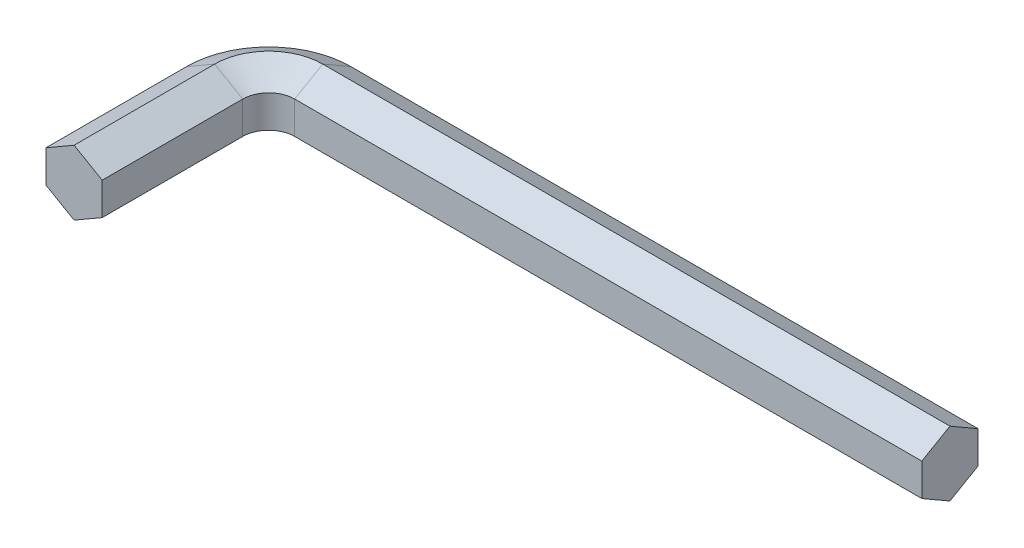
ISO-10303-21;
HEADER;
FILE_DESCRIPTION(('STEP AP214'),'2;1');
FILE_NAME('part.step','',(''),(''),'','','');
FILE_SCHEMA(('AUTOMOTIVE_DESIGN { 1 0 10303 214 1 1 1 1 }'));
ENDSEC;
DATA;
#1=APPLICATION_CONTEXT('core data for automotive mechanical design processes');
#2=APPLICATION_PROTOCOL_DEFINITION('international standard','automotive_design',2000,#1);
#3=PRODUCT_CONTEXT('',#1,'mechanical');
#4=PRODUCT('Part','Part','',(#3));
#5=PRODUCT_RELATED_PRODUCT_CATEGORY('part','',(#4));
#6=PRODUCT_DEFINITION_FORMATION('','',#4);
#7=PRODUCT_DEFINITION_CONTEXT('part definition',#1,'design');
#8=PRODUCT_DEFINITION('design','',#6,#7);
#9=PRODUCT_DEFINITION_SHAPE('','',#8);
#10=(LENGTH_UNIT() NAMED_UNIT(*) SI_UNIT(.MILLI.,.METRE.));
#11=(NAMED_UNIT(*) PLANE_ANGLE_UNIT() SI_UNIT($,.RADIAN.));
#12=(NAMED_UNIT(*) SI_UNIT($,.STERADIAN.) SOLID_ANGLE_UNIT());
#13=UNCERTAINTY_MEASURE_WITH_UNIT(LENGTH_MEASURE(1.E-05),#10,'distance_accuracy_value','');
#14=(GEOMETRIC_REPRESENTATION_CONTEXT(3) GLOBAL_UNCERTAINTY_ASSIGNED_CONTEXT((#13)) GLOBAL_UNIT_ASSIGNED_CONTEXT((#10,
#11,#12)) REPRESENTATION_CONTEXT('',''));
#15=CARTESIAN_POINT('',(0.,0.,0.));
#16=DIRECTION('',(0.,0.,1.));
#17=DIRECTION('',(1.,0.,0.));
#18=AXIS2_PLACEMENT_3D('',#15,#16,#17);
#19=CARTESIAN_POINT('',(-20.5,0.,6.99999999999999));
#20=DIRECTION('',(0.,0.,-1.));
#21=DIRECTION('',(-1.,0.,0.));
#22=AXIS2_PLACEMENT_3D('',#19,#20,#21);
#23=PLANE('',#22);
#24=DIRECTION('',(0.866025403784435,-0.500000000000005,0.));
#25=VECTOR('',#24,1.);
#26=CARTESIAN_POINT('',(-31.5,3.,6.99999999999999));
#27=LINE('',#26,#25);
#28=CARTESIAN_POINT('',(-31.5,3.,6.99999999999999));
#29=VERTEX_POINT('',#28);
#30=CARTESIAN_POINT('',(-28.9019237886467,1.49999999999998,6.99999999999999));
#31=VERTEX_POINT('',#30);
#32=EDGE_CURVE('E198',#29,#31,#27,.T.);
#33=ORIENTED_EDGE('',*,*,#32,.F.);
#34=DIRECTION('',(0.866025403784441,0.499999999999995,0.));
#35=VECTOR('',#34,1.);
#36=CARTESIAN_POINT('',(-34.0980762113533,1.50000000000002,6.99999999999999));
#37=LINE('',#36,#35);
#38=CARTESIAN_POINT('',(-34.0980762113533,1.50000000000002,6.99999999999999));
#39=VERTEX_POINT('',#38);
#40=EDGE_CURVE('E260',#39,#29,#37,.T.);
#41=ORIENTED_EDGE('',*,*,#40,.F.);
#42=DIRECTION('',(0.,1.,0.));
#43=VECTOR('',#42,1.);
#44=CARTESIAN_POINT('',(-34.0980762113533,-1.49999999999998,6.99999999999999));
#45=LINE('',#44,#43);
#46=CARTESIAN_POINT('',(-34.0980762113533,-1.49999999999998,6.99999999999999));
#47=VERTEX_POINT('',#46);
#48=EDGE_CURVE('E240',#47,#39,#45,.T.);
#49=ORIENTED_EDGE('',*,*,#48,.F.);
#50=DIRECTION('',(-0.866025403784436,0.500000000000005,0.));
#51=VECTOR('',#50,1.);
#52=CARTESIAN_POINT('',(-31.5,-3.,6.99999999999999));
#53=LINE('',#52,#51);
#54=CARTESIAN_POINT('',(-31.5,-3.,6.99999999999999));
#55=VERTEX_POINT('',#54);
#56=EDGE_CURVE('E145',#55,#47,#53,.T.);
#57=ORIENTED_EDGE('',*,*,#56,.F.);
#58=DIRECTION('',(-0.866025403784442,-0.499999999999995,0.));
#59=VECTOR('',#58,1.);
#60=CARTESIAN_POINT('',(-28.9019237886467,-1.50000000000002,6.99999999999999));
#61=LINE('',#60,#59);
#62=CARTESIAN_POINT('',(-28.9019237886467,-1.50000000000002,6.99999999999999));
#63=VERTEX_POINT('',#62);
#64=EDGE_CURVE('E149',#63,#55,#61,.T.);
#65=ORIENTED_EDGE('',*,*,#64,.F.);
#66=DIRECTION('',(0.,-1.,0.));
#67=VECTOR('',#66,1.);
#68=CARTESIAN_POINT('',(-28.9019237886467,1.49999999999998,6.99999999999999));
#69=LINE('',#68,#67);
#70=EDGE_CURVE('E154',#31,#63,#69,.T.);
#71=ORIENTED_EDGE('',*,*,#70,.F.);
#72=EDGE_LOOP('',(#33,#41,#49,#57,#65,#71));
#73=FACE_BOUND('',#72,.T.);
#74=ADVANCED_FACE('F43',(#73),#23,.F.);
#75=CARTESIAN_POINT('',(31.5,0.,0.));
#76=DIRECTION('',(1.,0.,0.));
#77=DIRECTION('',(0.,0.,-1.));
#78=AXIS2_PLACEMENT_3D('',#75,#76,#77);
#79=PLANE('',#78);
#80=DIRECTION('',(0.,-0.500000000000005,0.866025403784435));
#81=VECTOR('',#80,1.);
#82=CARTESIAN_POINT('',(31.5,3.,-11.));
#83=LINE('',#82,#81);
#84=CARTESIAN_POINT('',(31.5,3.,-11.));
#85=VERTEX_POINT('',#84);
#86=CARTESIAN_POINT('',(31.5,1.49999999999998,-8.40192378864668));
#87=VERTEX_POINT('',#86);
#88=EDGE_CURVE('E165',#85,#87,#83,.T.);
#89=ORIENTED_EDGE('',*,*,#88,.T.);
#90=DIRECTION('',(0.,-1.,0.));
#91=VECTOR('',#90,1.);
#92=CARTESIAN_POINT('',(31.5,1.49999999999998,-8.40192378864668));
#93=LINE('',#92,#91);
#94=CARTESIAN_POINT('',(31.5,-1.50000000000002,-8.40192378864669));
#95=VERTEX_POINT('',#94);
#96=EDGE_CURVE('E168',#87,#95,#93,.T.);
#97=ORIENTED_EDGE('',*,*,#96,.T.);
#98=DIRECTION('',(0.,-0.499999999999995,-0.866025403784442));
#99=VECTOR('',#98,1.);
#100=CARTESIAN_POINT('',(31.5,-1.50000000000002,-8.40192378864669));
#101=LINE('',#100,#99);
#102=CARTESIAN_POINT('',(31.5,-3.,-11.));
#103=VERTEX_POINT('',#102);
#104=EDGE_CURVE('E218',#95,#103,#101,.T.);
#105=ORIENTED_EDGE('',*,*,#104,.T.);
#106=DIRECTION('',(0.,0.500000000000005,-0.866025403784436));
#107=VECTOR('',#106,1.);
#108=CARTESIAN_POINT('',(31.5,-3.,-11.));
#109=LINE('',#108,#107);
#110=CARTESIAN_POINT('',(31.5,-1.49999999999998,-13.5980762113533));
#111=VERTEX_POINT('',#110);
#112=EDGE_CURVE('E63',#103,#111,#109,.T.);
#113=ORIENTED_EDGE('',*,*,#112,.T.);
#114=DIRECTION('',(0.,1.,0.));
#115=VECTOR('',#114,1.);
#116=CARTESIAN_POINT('',(31.5,-1.49999999999998,-13.5980762113533));
#117=LINE('',#116,#115);
#118=CARTESIAN_POINT('',(31.5,1.50000000000002,-13.5980762113533));
#119=VERTEX_POINT('',#118);
#120=EDGE_CURVE('E57',#111,#119,#117,.T.);
#121=ORIENTED_EDGE('',*,*,#120,.T.);
#122=DIRECTION('',(0.,0.499999999999995,0.866025403784441));
#123=VECTOR('',#122,1.);
#124=CARTESIAN_POINT('',(31.5,1.50000000000002,-13.5980762113533));
#125=LINE('',#124,#123);
#126=EDGE_CURVE('E11',#119,#85,#125,.T.);
#127=ORIENTED_EDGE('',*,*,#126,.T.);
#128=EDGE_LOOP('',(#89,#97,#105,#113,#121,#127));
#129=FACE_BOUND('',#128,.T.);
#130=ADVANCED_FACE('F167',(#129),#79,.T.);
#131=CARTESIAN_POINT('',(-31.5,3.,6.99999999999999));
#132=DIRECTION('',(0.500000000000005,0.866025403784436,0.));
#133=DIRECTION('',(-0.866025403784436,0.500000000000005,0.));
#134=AXIS2_PLACEMENT_3D('',#131,#132,#133);
#135=PLANE('',#134);
#136=DIRECTION('',(0.,0.,-1.));
#137=VECTOR('',#136,1.);
#138=CARTESIAN_POINT('',(-28.9019237886467,1.49999999999998,6.99999999999999));
#139=LINE('',#138,#137);
#140=CARTESIAN_POINT('',(-28.9019237886467,1.49999999999998,-5.99999999999999));
#141=VERTEX_POINT('',#140);
#142=EDGE_CURVE('E204',#31,#141,#139,.T.);
#143=ORIENTED_EDGE('',*,*,#142,.T.);
#144=DIRECTION('',(0.866025403784435,-0.500000000000005,0.));
#145=VECTOR('',#144,1.);
#146=CARTESIAN_POINT('',(-31.5,3.,-5.99999999999999));
#147=LINE('',#146,#145);
#148=CARTESIAN_POINT('',(-31.5,3.,-5.99999999999999));
#149=VERTEX_POINT('',#148);
#150=EDGE_CURVE('E305',#149,#141,#147,.T.);
#151=ORIENTED_EDGE('',*,*,#150,.F.);
#152=DIRECTION('',(0.,0.,-1.));
#153=VECTOR('',#152,1.);
#154=CARTESIAN_POINT('',(-31.5,3.,6.99999999999999));
#155=LINE('',#154,#153);
#156=EDGE_CURVE('E281',#29,#149,#155,.T.);
#157=ORIENTED_EDGE('',*,*,#156,.F.);
#158=ORIENTED_EDGE('',*,*,#32,.T.);
#159=EDGE_LOOP('',(#143,#151,#157,#158));
#160=FACE_BOUND('',#159,.T.);
#161=ADVANCED_FACE('F315',(#160),#135,.T.);
#162=CARTESIAN_POINT('',(-28.9019237886467,1.49999999999998,6.99999999999999));
#163=DIRECTION('',(1.,0.,0.));
#164=DIRECTION('',(0.,1.,0.));
#165=AXIS2_PLACEMENT_3D('',#162,#163,#164);
#166=PLANE('',#165);
#167=DIRECTION('',(0.,0.,-1.));
#168=VECTOR('',#167,1.);
#169=CARTESIAN_POINT('',(-28.9019237886467,-1.50000000000002,6.99999999999999));
#170=LINE('',#169,#168);
#171=CARTESIAN_POINT('',(-28.9019237886467,-1.50000000000002,-5.99999999999999));
#172=VERTEX_POINT('',#171);
#173=EDGE_CURVE('E203',#63,#172,#170,.T.);
#174=ORIENTED_EDGE('',*,*,#173,.T.);
#175=DIRECTION('',(0.,-1.,0.));
#176=VECTOR('',#175,1.);
#177=CARTESIAN_POINT('',(-28.9019237886467,1.49999999999998,-5.99999999999999));
#178=LINE('',#177,#176);
#179=EDGE_CURVE('E199',#141,#172,#178,.T.);
#180=ORIENTED_EDGE('',*,*,#179,.F.);
#181=ORIENTED_EDGE('',*,*,#142,.F.);
#182=ORIENTED_EDGE('',*,*,#70,.T.);
#183=EDGE_LOOP('',(#174,#180,#181,#182));
#184=FACE_BOUND('',#183,.T.);
#185=ADVANCED_FACE('F318',(#184),#166,.T.);
#186=CARTESIAN_POINT('',(-28.9019237886467,-1.50000000000002,6.99999999999999));
#187=DIRECTION('',(0.499999999999995,-0.866025403784442,0.));
#188=DIRECTION('',(0.866025403784442,0.499999999999995,0.));
#189=AXIS2_PLACEMENT_3D('',#186,#187,#188);
#190=PLANE('',#189);
#191=DIRECTION('',(0.,0.,-1.));
#192=VECTOR('',#191,1.);
#193=CARTESIAN_POINT('',(-31.5,-3.,6.99999999999999));
#194=LINE('',#193,#192);
#195=CARTESIAN_POINT('',(-31.5,-3.,-5.99999999999999));
#196=VERTEX_POINT('',#195);
#197=EDGE_CURVE('E223',#55,#196,#194,.T.);
#198=ORIENTED_EDGE('',*,*,#197,.T.);
#199=DIRECTION('',(-0.866025403784442,-0.499999999999995,0.));
#200=VECTOR('',#199,1.);
#201=CARTESIAN_POINT('',(-28.9019237886467,-1.50000000000002,-5.99999999999999));
#202=LINE('',#201,#200);
#203=EDGE_CURVE('E208',#172,#196,#202,.T.);
#204=ORIENTED_EDGE('',*,*,#203,.F.);
#205=ORIENTED_EDGE('',*,*,#173,.F.);
#206=ORIENTED_EDGE('',*,*,#64,.T.);
#207=EDGE_LOOP('',(#198,#204,#205,#206));
#208=FACE_BOUND('',#207,.T.);
#209=ADVANCED_FACE('F375',(#208),#190,.T.);
#210=CARTESIAN_POINT('',(-31.5,-3.,6.99999999999999));
#211=DIRECTION('',(-0.500000000000005,-0.866025403784436,0.));
#212=DIRECTION('',(0.866025403784436,-0.500000000000005,0.));
#213=AXIS2_PLACEMENT_3D('',#210,#211,#212);
#214=PLANE('',#213);
#215=DIRECTION('',(0.,0.,-1.));
#216=VECTOR('',#215,1.);
#217=CARTESIAN_POINT('',(-34.0980762113533,-1.49999999999998,6.99999999999999));
#218=LINE('',#217,#216);
#219=CARTESIAN_POINT('',(-34.0980762113533,-1.49999999999998,-5.99999999999999));
#220=VERTEX_POINT('',#219);
#221=EDGE_CURVE('E243',#47,#220,#218,.T.);
#222=ORIENTED_EDGE('',*,*,#221,.T.);
#223=DIRECTION('',(-0.866025403784436,0.500000000000005,0.));
#224=VECTOR('',#223,1.);
#225=CARTESIAN_POINT('',(-31.5,-3.,-5.99999999999999));
#226=LINE('',#225,#224);
#227=EDGE_CURVE('E227',#196,#220,#226,.T.);
#228=ORIENTED_EDGE('',*,*,#227,.F.);
#229=ORIENTED_EDGE('',*,*,#197,.F.);
#230=ORIENTED_EDGE('',*,*,#56,.T.);
#231=EDGE_LOOP('',(#222,#228,#229,#230));
#232=FACE_BOUND('',#231,.T.);
#233=ADVANCED_FACE('F384',(#232),#214,.T.);
#234=CARTESIAN_POINT('',(-34.0980762113533,-1.49999999999998,6.99999999999999));
#235=DIRECTION('',(-1.,0.,0.));
#236=DIRECTION('',(0.,-1.,0.));
#237=AXIS2_PLACEMENT_3D('',#234,#235,#236);
#238=PLANE('',#237);
#239=DIRECTION('',(0.,0.,-1.));
#240=VECTOR('',#239,1.);
#241=CARTESIAN_POINT('',(-34.0980762113533,1.50000000000002,6.99999999999999));
#242=LINE('',#241,#240);
#243=CARTESIAN_POINT('',(-34.0980762113533,1.50000000000002,-5.99999999999999));
#244=VERTEX_POINT('',#243);
#245=EDGE_CURVE('E263',#39,#244,#242,.T.);
#246=ORIENTED_EDGE('',*,*,#245,.T.);
#247=DIRECTION('',(0.,1.,0.));
#248=VECTOR('',#247,1.);
#249=CARTESIAN_POINT('',(-34.0980762113533,-1.49999999999998,-5.99999999999999));
#250=LINE('',#249,#248);
#251=EDGE_CURVE('E247',#220,#244,#250,.T.);
#252=ORIENTED_EDGE('',*,*,#251,.F.);
#253=ORIENTED_EDGE('',*,*,#221,.F.);
#254=ORIENTED_EDGE('',*,*,#48,.T.);
#255=EDGE_LOOP('',(#246,#252,#253,#254));
#256=FACE_BOUND('',#255,.T.);
#257=ADVANCED_FACE('F395',(#256),#238,.T.);
#258=CARTESIAN_POINT('',(-34.0980762113533,1.50000000000002,6.99999999999999));
#259=DIRECTION('',(-0.499999999999995,0.866025403784441,0.));
#260=DIRECTION('',(-0.866025403784441,-0.499999999999995,0.));
#261=AXIS2_PLACEMENT_3D('',#258,#259,#260);
#262=PLANE('',#261);
#263=DIRECTION('',(0.866025403784441,0.499999999999995,0.));
#264=VECTOR('',#263,1.);
#265=CARTESIAN_POINT('',(-34.0980762113533,1.50000000000002,-5.99999999999999));
#266=LINE('',#265,#264);
#267=EDGE_CURVE('E267',#244,#149,#266,.T.);
#268=ORIENTED_EDGE('',*,*,#267,.F.);
#269=ORIENTED_EDGE('',*,*,#245,.F.);
#270=ORIENTED_EDGE('',*,*,#40,.T.);
#271=ORIENTED_EDGE('',*,*,#156,.T.);
#272=EDGE_LOOP('',(#268,#269,#270,#271));
#273=FACE_BOUND('',#272,.T.);
#274=ADVANCED_FACE('F331',(#273),#262,.T.);
#275=CARTESIAN_POINT('',(-26.5,3.,-6.));
#276=DIRECTION('',(0.,1.,0.));
#277=DIRECTION('',(0.,0.,1.));
#278=AXIS2_PLACEMENT_3D('',#275,#276,#277);
#279=CONICAL_SURFACE('',#278,4.99999999999998,1.04719755119659);
#280=CARTESIAN_POINT('',(-26.5,1.49999999999998,-6.));
#281=DIRECTION('',(0.,-1.,0.));
#282=DIRECTION('',(-1.,0.,0.));
#283=AXIS2_PLACEMENT_3D('',#280,#281,#282);
#284=CIRCLE('',#283,2.40192378864667);
#285=CARTESIAN_POINT('',(-26.5,1.49999999999998,-8.40192378864667));
#286=VERTEX_POINT('',#285);
#287=EDGE_CURVE('E212',#141,#286,#284,.T.);
#288=ORIENTED_EDGE('',*,*,#287,.T.);
#289=DIRECTION('',(0.,-0.500000000000005,0.866025403784435));
#290=VECTOR('',#289,1.);
#291=CARTESIAN_POINT('',(-26.5,3.,-11.));
#292=LINE('',#291,#290);
#293=CARTESIAN_POINT('',(-26.5,3.,-11.));
#294=VERTEX_POINT('',#293);
#295=EDGE_CURVE('E188',#294,#286,#292,.T.);
#296=ORIENTED_EDGE('',*,*,#295,.F.);
#297=CARTESIAN_POINT('',(-26.5,3.,-6.));
#298=DIRECTION('',(0.,-1.,0.));
#299=DIRECTION('',(-1.,0.,0.));
#300=AXIS2_PLACEMENT_3D('',#297,#298,#299);
#301=CIRCLE('',#300,4.99999999999998);
#302=EDGE_CURVE('E284',#149,#294,#301,.T.);
#303=ORIENTED_EDGE('',*,*,#302,.F.);
#304=ORIENTED_EDGE('',*,*,#150,.T.);
#305=EDGE_LOOP('',(#288,#296,#303,#304));
#306=FACE_BOUND('',#305,.T.);
#307=ADVANCED_FACE('F291',(#306),#279,.F.);
#308=CARTESIAN_POINT('',(-26.5,0.,-6.));
#309=DIRECTION('',(0.,-1.,0.));
#310=DIRECTION('',(0.,0.,-1.));
#311=AXIS2_PLACEMENT_3D('',#308,#309,#310);
#312=CYLINDRICAL_SURFACE('',#311,2.40192378864668);
#313=CARTESIAN_POINT('',(-26.5,-1.50000000000002,-6.));
#314=DIRECTION('',(0.,-1.,0.));
#315=DIRECTION('',(-1.,0.,0.));
#316=AXIS2_PLACEMENT_3D('',#313,#314,#315);
#317=CIRCLE('',#316,2.40192378864669);
#318=CARTESIAN_POINT('',(-26.5,-1.50000000000002,-8.40192378864669));
#319=VERTEX_POINT('',#318);
#320=EDGE_CURVE('E132',#172,#319,#317,.T.);
#321=ORIENTED_EDGE('',*,*,#320,.T.);
#322=DIRECTION('',(0.,-1.,0.));
#323=VECTOR('',#322,1.);
#324=CARTESIAN_POINT('',(-26.5,1.49999999999998,-8.40192378864667));
#325=LINE('',#324,#323);
#326=EDGE_CURVE('E209',#286,#319,#325,.T.);
#327=ORIENTED_EDGE('',*,*,#326,.F.);
#328=ORIENTED_EDGE('',*,*,#287,.F.);
#329=ORIENTED_EDGE('',*,*,#179,.T.);
#330=EDGE_LOOP('',(#321,#327,#328,#329));
#331=FACE_BOUND('',#330,.T.);
#332=ADVANCED_FACE('F321',(#331),#312,.F.);
#333=CARTESIAN_POINT('',(-26.5,-1.50000000000002,-6.));
#334=DIRECTION('',(0.,-1.,0.));
#335=DIRECTION('',(0.,0.,-1.));
#336=AXIS2_PLACEMENT_3D('',#333,#334,#335);
#337=CONICAL_SURFACE('',#336,2.40192378864669,1.0471975511966);
#338=CARTESIAN_POINT('',(-26.5,-3.,-6.));
#339=DIRECTION('',(0.,-1.,0.));
#340=DIRECTION('',(-1.,0.,0.));
#341=AXIS2_PLACEMENT_3D('',#338,#339,#340);
#342=CIRCLE('',#341,5.00000000000001);
#343=CARTESIAN_POINT('',(-26.5,-3.,-11.));
#344=VERTEX_POINT('',#343);
#345=EDGE_CURVE('E123',#196,#344,#342,.T.);
#346=ORIENTED_EDGE('',*,*,#345,.T.);
#347=DIRECTION('',(0.,-0.499999999999995,-0.866025403784442));
#348=VECTOR('',#347,1.);
#349=CARTESIAN_POINT('',(-26.5,-1.50000000000002,-8.40192378864669));
#350=LINE('',#349,#348);
#351=EDGE_CURVE('E214',#319,#344,#350,.T.);
#352=ORIENTED_EDGE('',*,*,#351,.F.);
#353=ORIENTED_EDGE('',*,*,#320,.F.);
#354=ORIENTED_EDGE('',*,*,#203,.T.);
#355=EDGE_LOOP('',(#346,#352,#353,#354));
#356=FACE_BOUND('',#355,.T.);
#357=ADVANCED_FACE('F323',(#356),#337,.F.);
#358=CARTESIAN_POINT('',(-26.5,-3.,-6.));
#359=DIRECTION('',(0.,1.,0.));
#360=DIRECTION('',(0.,0.,1.));
#361=AXIS2_PLACEMENT_3D('',#358,#359,#360);
#362=CONICAL_SURFACE('',#361,5.00000000000001,1.04719755119659);
#363=CARTESIAN_POINT('',(-26.5,-1.49999999999998,-6.));
#364=DIRECTION('',(0.,-1.,0.));
#365=DIRECTION('',(-1.,0.,0.));
#366=AXIS2_PLACEMENT_3D('',#363,#364,#365);
#367=CIRCLE('',#366,7.59807621135332);
#368=CARTESIAN_POINT('',(-26.5,-1.49999999999998,-13.5980762113533));
#369=VERTEX_POINT('',#368);
#370=EDGE_CURVE('E116',#220,#369,#367,.T.);
#371=ORIENTED_EDGE('',*,*,#370,.T.);
#372=DIRECTION('',(0.,0.500000000000005,-0.866025403784436));
#373=VECTOR('',#372,1.);
#374=CARTESIAN_POINT('',(-26.5,-3.,-11.));
#375=LINE('',#374,#373);
#376=EDGE_CURVE('E233',#344,#369,#375,.T.);
#377=ORIENTED_EDGE('',*,*,#376,.F.);
#378=ORIENTED_EDGE('',*,*,#345,.F.);
#379=ORIENTED_EDGE('',*,*,#227,.T.);
#380=EDGE_LOOP('',(#371,#377,#378,#379));
#381=FACE_BOUND('',#380,.T.);
#382=ADVANCED_FACE('F329',(#381),#362,.T.);
#383=CARTESIAN_POINT('',(-26.5,0.,-6.));
#384=DIRECTION('',(0.,-1.,0.));
#385=DIRECTION('',(0.,0.,-1.));
#386=AXIS2_PLACEMENT_3D('',#383,#384,#385);
#387=CYLINDRICAL_SURFACE('',#386,7.59807621135331);
#388=CARTESIAN_POINT('',(-26.5,1.50000000000002,-6.));
#389=DIRECTION('',(0.,-1.,0.));
#390=DIRECTION('',(-1.,0.,0.));
#391=AXIS2_PLACEMENT_3D('',#388,#389,#390);
#392=CIRCLE('',#391,7.5980762113533);
#393=CARTESIAN_POINT('',(-26.5,1.50000000000002,-13.5980762113533));
#394=VERTEX_POINT('',#393);
#395=EDGE_CURVE('E270',#244,#394,#392,.T.);
#396=ORIENTED_EDGE('',*,*,#395,.T.);
#397=DIRECTION('',(0.,1.,0.));
#398=VECTOR('',#397,1.);
#399=CARTESIAN_POINT('',(-26.5,-1.49999999999998,-13.5980762113533));
#400=LINE('',#399,#398);
#401=EDGE_CURVE('E252',#369,#394,#400,.T.);
#402=ORIENTED_EDGE('',*,*,#401,.F.);
#403=ORIENTED_EDGE('',*,*,#370,.F.);
#404=ORIENTED_EDGE('',*,*,#251,.T.);
#405=EDGE_LOOP('',(#396,#402,#403,#404));
#406=FACE_BOUND('',#405,.T.);
#407=ADVANCED_FACE('F444',(#406),#387,.T.);
#408=CARTESIAN_POINT('',(-26.5,1.50000000000002,-6.));
#409=DIRECTION('',(0.,-1.,0.));
#410=DIRECTION('',(0.,0.,-1.));
#411=AXIS2_PLACEMENT_3D('',#408,#409,#410);
#412=CONICAL_SURFACE('',#411,7.5980762113533,1.0471975511966);
#413=DIRECTION('',(0.,0.499999999999995,0.866025403784441));
#414=VECTOR('',#413,1.);
#415=CARTESIAN_POINT('',(-26.5,1.50000000000002,-13.5980762113533));
#416=LINE('',#415,#414);
#417=EDGE_CURVE('E195',#394,#294,#416,.T.);
#418=ORIENTED_EDGE('',*,*,#417,.F.);
#419=ORIENTED_EDGE('',*,*,#395,.F.);
#420=ORIENTED_EDGE('',*,*,#267,.T.);
#421=ORIENTED_EDGE('',*,*,#302,.T.);
#422=EDGE_LOOP('',(#418,#419,#420,#421));
#423=FACE_BOUND('',#422,.T.);
#424=ADVANCED_FACE('F295',(#423),#412,.T.);
#425=CARTESIAN_POINT('',(-26.5,3.,-11.));
#426=DIRECTION('',(0.,0.866025403784435,0.500000000000005));
#427=DIRECTION('',(0.,-0.500000000000005,0.866025403784436));
#428=AXIS2_PLACEMENT_3D('',#425,#426,#427);
#429=PLANE('',#428);
#430=DIRECTION('',(1.,0.,0.));
#431=VECTOR('',#430,1.);
#432=CARTESIAN_POINT('',(-26.5,1.49999999999998,-8.40192378864668));
#433=LINE('',#432,#431);
#434=EDGE_CURVE('E174',#286,#87,#433,.T.);
#435=ORIENTED_EDGE('',*,*,#434,.T.);
#436=ORIENTED_EDGE('',*,*,#88,.F.);
#437=DIRECTION('',(1.,0.,0.));
#438=VECTOR('',#437,1.);
#439=CARTESIAN_POINT('',(-26.5,3.,-11.));
#440=LINE('',#439,#438);
#441=EDGE_CURVE('E175',#294,#85,#440,.T.);
#442=ORIENTED_EDGE('',*,*,#441,.F.);
#443=ORIENTED_EDGE('',*,*,#295,.T.);
#444=EDGE_LOOP('',(#435,#436,#442,#443));
#445=FACE_BOUND('',#444,.T.);
#446=ADVANCED_FACE('F186',(#445),#429,.T.);
#447=CARTESIAN_POINT('',(-26.5,1.49999999999998,-8.40192378864668));
#448=DIRECTION('',(0.,0.,1.));
#449=DIRECTION('',(0.,-1.,0.));
#450=AXIS2_PLACEMENT_3D('',#447,#448,#449);
#451=PLANE('',#450);
#452=DIRECTION('',(1.,0.,0.));
#453=VECTOR('',#452,1.);
#454=CARTESIAN_POINT('',(-26.5,-1.50000000000002,-8.40192378864669));
#455=LINE('',#454,#453);
#456=EDGE_CURVE('E182',#319,#95,#455,.T.);
#457=ORIENTED_EDGE('',*,*,#456,.T.);
#458=ORIENTED_EDGE('',*,*,#96,.F.);
#459=ORIENTED_EDGE('',*,*,#434,.F.);
#460=ORIENTED_EDGE('',*,*,#326,.T.);
#461=EDGE_LOOP('',(#457,#458,#459,#460));
#462=FACE_BOUND('',#461,.T.);
#463=ADVANCED_FACE('F179',(#462),#451,.T.);
#464=CARTESIAN_POINT('',(-26.5,-1.50000000000002,-8.40192378864669));
#465=DIRECTION('',(0.,-0.866025403784442,0.499999999999995));
#466=DIRECTION('',(0.,-0.499999999999995,-0.866025403784442));
#467=AXIS2_PLACEMENT_3D('',#464,#465,#466);
#468=PLANE('',#467);
#469=DIRECTION('',(1.,0.,0.));
#470=VECTOR('',#469,1.);
#471=CARTESIAN_POINT('',(-26.5,-3.,-11.));
#472=LINE('',#471,#470);
#473=EDGE_CURVE('E101',#344,#103,#472,.T.);
#474=ORIENTED_EDGE('',*,*,#473,.T.);
#475=ORIENTED_EDGE('',*,*,#104,.F.);
#476=ORIENTED_EDGE('',*,*,#456,.F.);
#477=ORIENTED_EDGE('',*,*,#351,.T.);
#478=EDGE_LOOP('',(#474,#475,#476,#477));
#479=FACE_BOUND('',#478,.T.);
#480=ADVANCED_FACE('F480',(#479),#468,.T.);
#481=CARTESIAN_POINT('',(-26.5,-3.,-11.));
#482=DIRECTION('',(0.,-0.866025403784436,-0.500000000000005));
#483=DIRECTION('',(0.,0.500000000000005,-0.866025403784436));
#484=AXIS2_PLACEMENT_3D('',#481,#482,#483);
#485=PLANE('',#484);
#486=DIRECTION('',(1.,0.,0.));
#487=VECTOR('',#486,1.);
#488=CARTESIAN_POINT('',(-26.5,-1.49999999999998,-13.5980762113533));
#489=LINE('',#488,#487);
#490=EDGE_CURVE('E93',#369,#111,#489,.T.);
#491=ORIENTED_EDGE('',*,*,#490,.T.);
#492=ORIENTED_EDGE('',*,*,#112,.F.);
#493=ORIENTED_EDGE('',*,*,#473,.F.);
#494=ORIENTED_EDGE('',*,*,#376,.T.);
#495=EDGE_LOOP('',(#491,#492,#493,#494));
#496=FACE_BOUND('',#495,.T.);
#497=ADVANCED_FACE('F341',(#496),#485,.T.);
#498=CARTESIAN_POINT('',(-26.5,-1.49999999999998,-13.5980762113533));
#499=DIRECTION('',(0.,0.,-1.));
#500=DIRECTION('',(0.,1.,0.));
#501=AXIS2_PLACEMENT_3D('',#498,#499,#500);
#502=PLANE('',#501);
#503=DIRECTION('',(1.,0.,0.));
#504=VECTOR('',#503,1.);
#505=CARTESIAN_POINT('',(-26.5,1.50000000000002,-13.5980762113533));
#506=LINE('',#505,#504);
#507=EDGE_CURVE('E51',#394,#119,#506,.T.);
#508=ORIENTED_EDGE('',*,*,#507,.T.);
#509=ORIENTED_EDGE('',*,*,#120,.F.);
#510=ORIENTED_EDGE('',*,*,#490,.F.);
#511=ORIENTED_EDGE('',*,*,#401,.T.);
#512=EDGE_LOOP('',(#508,#509,#510,#511));
#513=FACE_BOUND('',#512,.T.);
#514=ADVANCED_FACE('F336',(#513),#502,.T.);
#515=CARTESIAN_POINT('',(-26.5,1.50000000000002,-13.5980762113533));
#516=DIRECTION('',(0.,0.866025403784441,-0.499999999999995));
#517=DIRECTION('',(0.,0.499999999999995,0.866025403784441));
#518=AXIS2_PLACEMENT_3D('',#515,#516,#517);
#519=PLANE('',#518);
#520=ORIENTED_EDGE('',*,*,#126,.F.);
#521=ORIENTED_EDGE('',*,*,#507,.F.);
#522=ORIENTED_EDGE('',*,*,#417,.T.);
#523=ORIENTED_EDGE('',*,*,#441,.T.);
#524=EDGE_LOOP('',(#520,#521,#522,#523));
#525=FACE_BOUND('',#524,.T.);
#526=ADVANCED_FACE('F286',(#525),#519,.T.);
#527=CLOSED_SHELL('',(#74,#130,#161,#185,#209,#233,#257,#274,#307,#332,#357,#382,#407,#424,#446,
#463,#480,#497,#514,#526));
#528=MANIFOLD_SOLID_BREP('B2',#527);
#529=ADVANCED_BREP_SHAPE_REPRESENTATION('',(#18,#528),#14);
#530=SHAPE_DEFINITION_REPRESENTATION(#9,#529);
ENDSEC;
END-ISO-10303-21;
